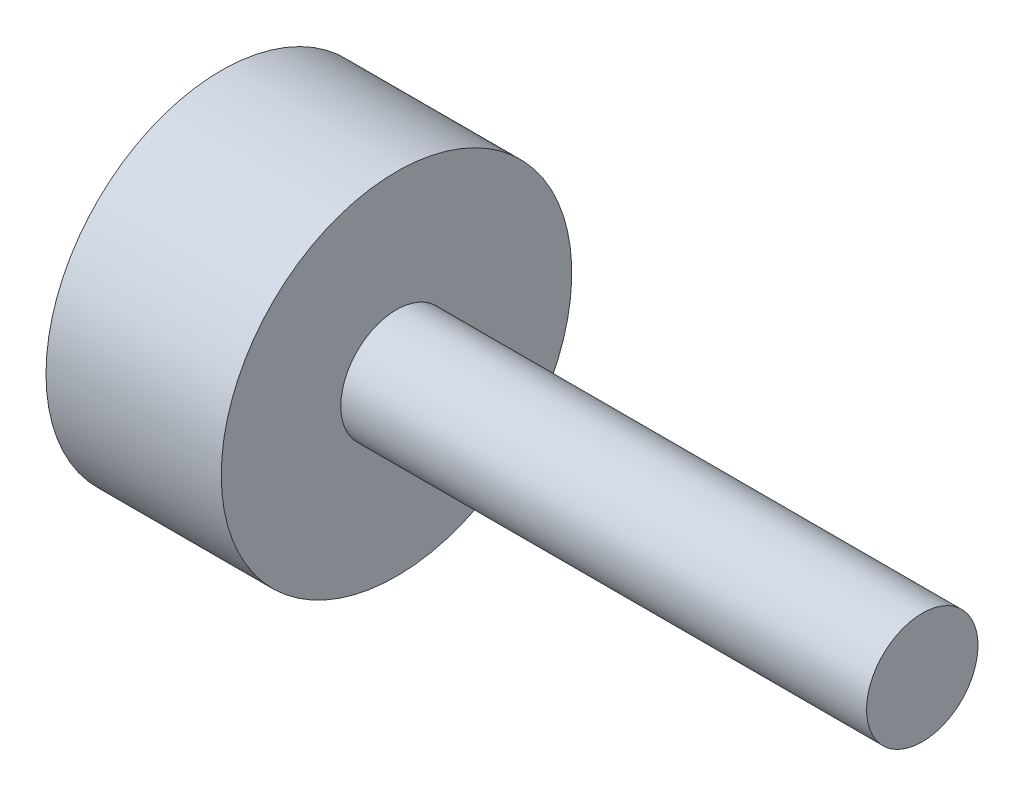
ISO-10303-21;
HEADER;
FILE_DESCRIPTION(('STEP AP214'),'2;1');
FILE_NAME('part.step','',(''),(''),'','','');
FILE_SCHEMA(('AUTOMOTIVE_DESIGN { 1 0 10303 214 1 1 1 1 }'));
ENDSEC;
DATA;
#1=APPLICATION_CONTEXT('core data for automotive mechanical design processes');
#2=APPLICATION_PROTOCOL_DEFINITION('international standard','automotive_design',2000,#1);
#3=PRODUCT_CONTEXT('',#1,'mechanical');
#4=PRODUCT('Part','Part','',(#3));
#5=PRODUCT_RELATED_PRODUCT_CATEGORY('part','',(#4));
#6=PRODUCT_DEFINITION_FORMATION('','',#4);
#7=PRODUCT_DEFINITION_CONTEXT('part definition',#1,'design');
#8=PRODUCT_DEFINITION('design','',#6,#7);
#9=PRODUCT_DEFINITION_SHAPE('','',#8);
#10=(LENGTH_UNIT() NAMED_UNIT(*) SI_UNIT(.MILLI.,.METRE.));
#11=(NAMED_UNIT(*) PLANE_ANGLE_UNIT() SI_UNIT($,.RADIAN.));
#12=(NAMED_UNIT(*) SI_UNIT($,.STERADIAN.) SOLID_ANGLE_UNIT());
#13=UNCERTAINTY_MEASURE_WITH_UNIT(LENGTH_MEASURE(1.E-05),#10,'distance_accuracy_value','');
#14=(GEOMETRIC_REPRESENTATION_CONTEXT(3) GLOBAL_UNCERTAINTY_ASSIGNED_CONTEXT((#13)) GLOBAL_UNIT_ASSIGNED_CONTEXT((#10,
#11,#12)) REPRESENTATION_CONTEXT('',''));
#15=CARTESIAN_POINT('',(0.,0.,0.));
#16=DIRECTION('',(0.,0.,1.));
#17=DIRECTION('',(1.,0.,0.));
#18=AXIS2_PLACEMENT_3D('',#15,#16,#17);
#19=CARTESIAN_POINT('',(15.,0.,0.));
#20=DIRECTION('',(-1.,0.,0.));
#21=DIRECTION('',(0.,0.,1.));
#22=AXIS2_PLACEMENT_3D('',#19,#20,#21);
#23=CYLINDRICAL_SURFACE('',#22,1.59);
#24=CARTESIAN_POINT('',(15.,0.,0.));
#25=DIRECTION('',(1.,0.,0.));
#26=DIRECTION('',(0.,0.,-1.));
#27=AXIS2_PLACEMENT_3D('',#24,#25,#26);
#28=CIRCLE('',#27,1.59);
#29=CARTESIAN_POINT('',(15.,0.,-1.59));
#30=VERTEX_POINT('',#29);
#31=EDGE_CURVE('E10',#30,#30,#28,.T.);
#32=ORIENTED_EDGE('',*,*,#31,.F.);
#33=EDGE_LOOP('',(#32));
#34=FACE_BOUND('',#33,.T.);
#35=CARTESIAN_POINT('',(0.,0.,0.));
#36=DIRECTION('',(-1.,0.,0.));
#37=DIRECTION('',(0.,0.,1.));
#38=AXIS2_PLACEMENT_3D('',#35,#36,#37);
#39=CIRCLE('',#38,1.59);
#40=CARTESIAN_POINT('',(0.,0.,1.59));
#41=VERTEX_POINT('',#40);
#42=EDGE_CURVE('E36',#41,#41,#39,.T.);
#43=ORIENTED_EDGE('',*,*,#42,.F.);
#44=EDGE_LOOP('',(#43));
#45=FACE_BOUND('',#44,.T.);
#46=ADVANCED_FACE('F30',(#34,#45),#23,.T.);
#47=CARTESIAN_POINT('',(15.,0.,0.));
#48=DIRECTION('',(1.,0.,0.));
#49=DIRECTION('',(0.,0.,-1.));
#50=AXIS2_PLACEMENT_3D('',#47,#48,#49);
#51=PLANE('',#50);
#52=ORIENTED_EDGE('',*,*,#31,.T.);
#53=EDGE_LOOP('',(#52));
#54=FACE_BOUND('',#53,.T.);
#55=ADVANCED_FACE('F78',(#54),#51,.T.);
#56=CARTESIAN_POINT('',(0.,0.,0.));
#57=DIRECTION('',(-1.,0.,0.));
#58=DIRECTION('',(0.,0.,1.));
#59=AXIS2_PLACEMENT_3D('',#56,#57,#58);
#60=PLANE('',#59);
#61=CARTESIAN_POINT('',(0.,0.,0.));
#62=DIRECTION('',(-1.,0.,0.));
#63=DIRECTION('',(0.,0.,1.));
#64=AXIS2_PLACEMENT_3D('',#61,#62,#63);
#65=CIRCLE('',#64,5.);
#66=CARTESIAN_POINT('',(0.,0.,5.));
#67=VERTEX_POINT('',#66);
#68=EDGE_CURVE('E44',#67,#67,#65,.T.);
#69=ORIENTED_EDGE('',*,*,#68,.F.);
#70=EDGE_LOOP('',(#69));
#71=FACE_BOUND('',#70,.T.);
#72=ORIENTED_EDGE('',*,*,#42,.T.);
#73=EDGE_LOOP('',(#72));
#74=FACE_BOUND('',#73,.T.);
#75=ADVANCED_FACE('F73',(#71,#74),#60,.F.);
#76=CARTESIAN_POINT('',(-5.,0.,0.));
#77=DIRECTION('',(1.,0.,0.));
#78=DIRECTION('',(0.,0.,-1.));
#79=AXIS2_PLACEMENT_3D('',#76,#77,#78);
#80=CYLINDRICAL_SURFACE('',#79,5.);
#81=CARTESIAN_POINT('',(-5.,0.,0.));
#82=DIRECTION('',(-1.,0.,0.));
#83=DIRECTION('',(0.,0.,1.));
#84=AXIS2_PLACEMENT_3D('',#81,#82,#83);
#85=CIRCLE('',#84,5.);
#86=CARTESIAN_POINT('',(-5.,0.,5.));
#87=VERTEX_POINT('',#86);
#88=EDGE_CURVE('E40',#87,#87,#85,.T.);
#89=ORIENTED_EDGE('',*,*,#88,.F.);
#90=EDGE_LOOP('',(#89));
#91=FACE_BOUND('',#90,.T.);
#92=ORIENTED_EDGE('',*,*,#68,.T.);
#93=EDGE_LOOP('',(#92));
#94=FACE_BOUND('',#93,.T.);
#95=ADVANCED_FACE('F67',(#91,#94),#80,.T.);
#96=CARTESIAN_POINT('',(-5.,0.,0.));
#97=DIRECTION('',(-1.,0.,0.));
#98=DIRECTION('',(0.,0.,1.));
#99=AXIS2_PLACEMENT_3D('',#96,#97,#98);
#100=PLANE('',#99);
#101=CARTESIAN_POINT('',(-5.,0.,0.));
#102=DIRECTION('',(-1.,0.,0.));
#103=DIRECTION('',(0.,0.,1.));
#104=AXIS2_PLACEMENT_3D('',#101,#102,#103);
#105=CIRCLE('',#104,1.);
#106=CARTESIAN_POINT('',(-5.,0.,1.));
#107=VERTEX_POINT('',#106);
#108=EDGE_CURVE('E50',#107,#107,#105,.T.);
#109=ORIENTED_EDGE('',*,*,#108,.F.);
#110=EDGE_LOOP('',(#109));
#111=FACE_BOUND('',#110,.T.);
#112=ORIENTED_EDGE('',*,*,#88,.T.);
#113=EDGE_LOOP('',(#112));
#114=FACE_BOUND('',#113,.T.);
#115=ADVANCED_FACE('F61',(#111,#114),#100,.T.);
#116=CARTESIAN_POINT('',(0.,0.,0.));
#117=DIRECTION('',(-1.,0.,0.));
#118=DIRECTION('',(0.,0.,1.));
#119=AXIS2_PLACEMENT_3D('',#116,#117,#118);
#120=CYLINDRICAL_SURFACE('',#119,1.);
#121=CARTESIAN_POINT('',(0.,0.,0.));
#122=DIRECTION('',(-1.,0.,0.));
#123=DIRECTION('',(0.,0.,1.));
#124=AXIS2_PLACEMENT_3D('',#121,#122,#123);
#125=CIRCLE('',#124,1.);
#126=CARTESIAN_POINT('',(0.,0.,1.));
#127=VERTEX_POINT('',#126);
#128=EDGE_CURVE('E48',#127,#127,#125,.T.);
#129=ORIENTED_EDGE('',*,*,#128,.F.);
#130=EDGE_LOOP('',(#129));
#131=FACE_BOUND('',#130,.T.);
#132=ORIENTED_EDGE('',*,*,#108,.T.);
#133=EDGE_LOOP('',(#132));
#134=FACE_BOUND('',#133,.T.);
#135=ADVANCED_FACE('F58',(#131,#134),#120,.F.);
#136=CARTESIAN_POINT('',(0.,0.,0.));
#137=DIRECTION('',(-1.,0.,0.));
#138=DIRECTION('',(0.,0.,1.));
#139=AXIS2_PLACEMENT_3D('',#136,#137,#138);
#140=PLANE('',#139);
#141=ORIENTED_EDGE('',*,*,#128,.T.);
#142=EDGE_LOOP('',(#141));
#143=FACE_BOUND('',#142,.T.);
#144=ADVANCED_FACE('F56',(#143),#140,.T.);
#145=CLOSED_SHELL('',(#46,#55,#75,#95,#115,#135,#144));
#146=MANIFOLD_SOLID_BREP('B2',#145);
#147=ADVANCED_BREP_SHAPE_REPRESENTATION('',(#18,#146),#14);
#148=SHAPE_DEFINITION_REPRESENTATION(#9,#147);
ENDSEC;
END-ISO-10303-21;
